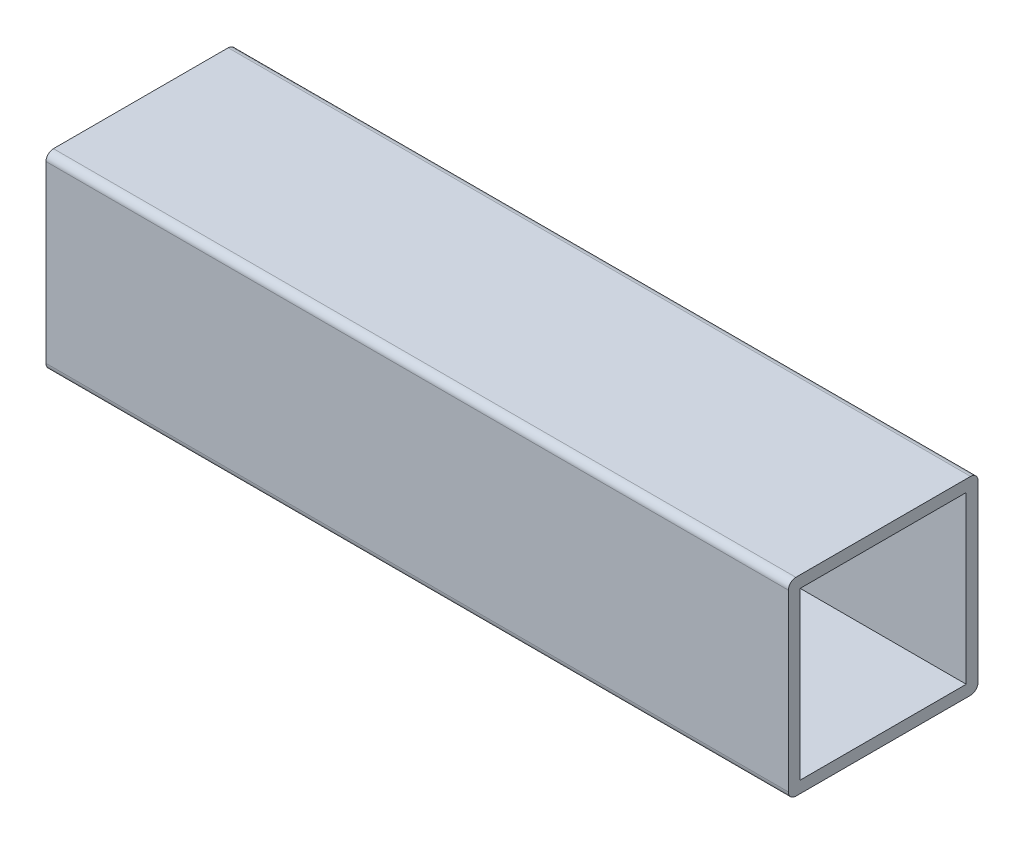
ISO-10303-21;
HEADER;
FILE_DESCRIPTION(('STEP AP214'),'2;1');
FILE_NAME('part.step','',(''),(''),'','','');
FILE_SCHEMA(('AUTOMOTIVE_DESIGN { 1 0 10303 214 1 1 1 1 }'));
ENDSEC;
DATA;
#1=APPLICATION_CONTEXT('core data for automotive mechanical design processes');
#2=APPLICATION_PROTOCOL_DEFINITION('international standard','automotive_design',2000,#1);
#3=PRODUCT_CONTEXT('',#1,'mechanical');
#4=PRODUCT('Part','Part','',(#3));
#5=PRODUCT_RELATED_PRODUCT_CATEGORY('part','',(#4));
#6=PRODUCT_DEFINITION_FORMATION('','',#4);
#7=PRODUCT_DEFINITION_CONTEXT('part definition',#1,'design');
#8=PRODUCT_DEFINITION('design','',#6,#7);
#9=PRODUCT_DEFINITION_SHAPE('','',#8);
#10=(LENGTH_UNIT() NAMED_UNIT(*) SI_UNIT(.MILLI.,.METRE.));
#11=(NAMED_UNIT(*) PLANE_ANGLE_UNIT() SI_UNIT($,.RADIAN.));
#12=(NAMED_UNIT(*) SI_UNIT($,.STERADIAN.) SOLID_ANGLE_UNIT());
#13=UNCERTAINTY_MEASURE_WITH_UNIT(LENGTH_MEASURE(1.E-05),#10,'distance_accuracy_value','');
#14=(GEOMETRIC_REPRESENTATION_CONTEXT(3) GLOBAL_UNCERTAINTY_ASSIGNED_CONTEXT((#13)) GLOBAL_UNIT_ASSIGNED_CONTEXT((#10,
#11,#12)) REPRESENTATION_CONTEXT('',''));
#15=CARTESIAN_POINT('',(0.,0.,0.));
#16=DIRECTION('',(0.,0.,1.));
#17=DIRECTION('',(1.,0.,0.));
#18=AXIS2_PLACEMENT_3D('',#15,#16,#17);
#19=CARTESIAN_POINT('',(-50.,-12.77,-12.77));
#20=DIRECTION('',(0.,0.,-1.));
#21=DIRECTION('',(-1.,0.,0.));
#22=AXIS2_PLACEMENT_3D('',#19,#20,#21);
#23=PLANE('',#22);
#24=DIRECTION('',(0.,1.,0.));
#25=VECTOR('',#24,1.);
#26=CARTESIAN_POINT('',(-50.,-12.77,-12.77));
#27=LINE('',#26,#25);
#28=CARTESIAN_POINT('',(-50.,-11.77,-12.77));
#29=VERTEX_POINT('',#28);
#30=CARTESIAN_POINT('',(-50.,11.77,-12.77));
#31=VERTEX_POINT('',#30);
#32=EDGE_CURVE('E175',#29,#31,#27,.T.);
#33=ORIENTED_EDGE('',*,*,#32,.T.);
#34=DIRECTION('',(1.,0.,0.));
#35=VECTOR('',#34,1.);
#36=CARTESIAN_POINT('',(-50.,11.77,-12.77));
#37=LINE('',#36,#35);
#38=CARTESIAN_POINT('',(50.,11.77,-12.77));
#39=VERTEX_POINT('',#38);
#40=EDGE_CURVE('E216',#31,#39,#37,.T.);
#41=ORIENTED_EDGE('',*,*,#40,.T.);
#42=DIRECTION('',(0.,1.,0.));
#43=VECTOR('',#42,1.);
#44=CARTESIAN_POINT('',(50.,-12.77,-12.77));
#45=LINE('',#44,#43);
#46=CARTESIAN_POINT('',(50.,-11.77,-12.77));
#47=VERTEX_POINT('',#46);
#48=EDGE_CURVE('E154',#47,#39,#45,.T.);
#49=ORIENTED_EDGE('',*,*,#48,.F.);
#50=DIRECTION('',(1.,0.,0.));
#51=VECTOR('',#50,1.);
#52=CARTESIAN_POINT('',(-50.,-11.77,-12.77));
#53=LINE('',#52,#51);
#54=EDGE_CURVE('E214',#47,#29,#53,.F.);
#55=ORIENTED_EDGE('',*,*,#54,.T.);
#56=EDGE_LOOP('',(#33,#41,#49,#55));
#57=FACE_BOUND('',#56,.T.);
#58=ADVANCED_FACE('F33',(#57),#23,.T.);
#59=CARTESIAN_POINT('',(-50.,-12.77,12.77));
#60=DIRECTION('',(0.,-1.,0.));
#61=DIRECTION('',(0.,0.,-1.));
#62=AXIS2_PLACEMENT_3D('',#59,#60,#61);
#63=PLANE('',#62);
#64=DIRECTION('',(0.,0.,-1.));
#65=VECTOR('',#64,1.);
#66=CARTESIAN_POINT('',(-50.,-12.77,12.77));
#67=LINE('',#66,#65);
#68=CARTESIAN_POINT('',(-50.,-12.77,11.77));
#69=VERTEX_POINT('',#68);
#70=CARTESIAN_POINT('',(-50.,-12.77,-11.77));
#71=VERTEX_POINT('',#70);
#72=EDGE_CURVE('E187',#69,#71,#67,.T.);
#73=ORIENTED_EDGE('',*,*,#72,.T.);
#74=DIRECTION('',(1.,0.,0.));
#75=VECTOR('',#74,1.);
#76=CARTESIAN_POINT('',(-50.,-12.77,-11.77));
#77=LINE('',#76,#75);
#78=CARTESIAN_POINT('',(50.,-12.77,-11.77));
#79=VERTEX_POINT('',#78);
#80=EDGE_CURVE('E11',#71,#79,#77,.T.);
#81=ORIENTED_EDGE('',*,*,#80,.T.);
#82=DIRECTION('',(0.,0.,-1.));
#83=VECTOR('',#82,1.);
#84=CARTESIAN_POINT('',(50.,-12.77,12.77));
#85=LINE('',#84,#83);
#86=CARTESIAN_POINT('',(50.,-12.77,11.77));
#87=VERTEX_POINT('',#86);
#88=EDGE_CURVE('E163',#87,#79,#85,.T.);
#89=ORIENTED_EDGE('',*,*,#88,.F.);
#90=DIRECTION('',(1.,0.,0.));
#91=VECTOR('',#90,1.);
#92=CARTESIAN_POINT('',(-50.,-12.77,11.77));
#93=LINE('',#92,#91);
#94=EDGE_CURVE('E41',#87,#69,#93,.F.);
#95=ORIENTED_EDGE('',*,*,#94,.T.);
#96=EDGE_LOOP('',(#73,#81,#89,#95));
#97=FACE_BOUND('',#96,.T.);
#98=ADVANCED_FACE('F229',(#97),#63,.T.);
#99=CARTESIAN_POINT('',(-50.,-12.77,12.77));
#100=DIRECTION('',(0.,0.,1.));
#101=DIRECTION('',(1.,0.,0.));
#102=AXIS2_PLACEMENT_3D('',#99,#100,#101);
#103=PLANE('',#102);
#104=DIRECTION('',(0.,-1.,0.));
#105=VECTOR('',#104,1.);
#106=CARTESIAN_POINT('',(50.,-12.77,12.77));
#107=LINE('',#106,#105);
#108=CARTESIAN_POINT('',(50.,11.77,12.77));
#109=VERTEX_POINT('',#108);
#110=CARTESIAN_POINT('',(50.,-11.77,12.77));
#111=VERTEX_POINT('',#110);
#112=EDGE_CURVE('E160',#109,#111,#107,.T.);
#113=ORIENTED_EDGE('',*,*,#112,.F.);
#114=DIRECTION('',(1.,0.,0.));
#115=VECTOR('',#114,1.);
#116=CARTESIAN_POINT('',(-50.,11.77,12.77));
#117=LINE('',#116,#115);
#118=CARTESIAN_POINT('',(-50.,11.77,12.77));
#119=VERTEX_POINT('',#118);
#120=EDGE_CURVE('E205',#109,#119,#117,.F.);
#121=ORIENTED_EDGE('',*,*,#120,.T.);
#122=DIRECTION('',(0.,-1.,0.));
#123=VECTOR('',#122,1.);
#124=CARTESIAN_POINT('',(-50.,-12.77,12.77));
#125=LINE('',#124,#123);
#126=CARTESIAN_POINT('',(-50.,-11.77,12.77));
#127=VERTEX_POINT('',#126);
#128=EDGE_CURVE('E184',#119,#127,#125,.T.);
#129=ORIENTED_EDGE('',*,*,#128,.T.);
#130=DIRECTION('',(1.,0.,0.));
#131=VECTOR('',#130,1.);
#132=CARTESIAN_POINT('',(-50.,-11.77,12.77));
#133=LINE('',#132,#131);
#134=EDGE_CURVE('E202',#127,#111,#133,.T.);
#135=ORIENTED_EDGE('',*,*,#134,.T.);
#136=EDGE_LOOP('',(#113,#121,#129,#135));
#137=FACE_BOUND('',#136,.T.);
#138=ADVANCED_FACE('F237',(#137),#103,.T.);
#139=CARTESIAN_POINT('',(-50.,12.77,12.77));
#140=DIRECTION('',(0.,1.,0.));
#141=DIRECTION('',(0.,0.,1.));
#142=AXIS2_PLACEMENT_3D('',#139,#140,#141);
#143=PLANE('',#142);
#144=DIRECTION('',(0.,0.,1.));
#145=VECTOR('',#144,1.);
#146=CARTESIAN_POINT('',(-50.,12.77,12.77));
#147=LINE('',#146,#145);
#148=CARTESIAN_POINT('',(-50.,12.77,-11.77));
#149=VERTEX_POINT('',#148);
#150=CARTESIAN_POINT('',(-50.,12.77,11.77));
#151=VERTEX_POINT('',#150);
#152=EDGE_CURVE('E181',#149,#151,#147,.T.);
#153=ORIENTED_EDGE('',*,*,#152,.T.);
#154=DIRECTION('',(1.,0.,0.));
#155=VECTOR('',#154,1.);
#156=CARTESIAN_POINT('',(-50.,12.77,11.77));
#157=LINE('',#156,#155);
#158=CARTESIAN_POINT('',(50.,12.77,11.77));
#159=VERTEX_POINT('',#158);
#160=EDGE_CURVE('E191',#151,#159,#157,.T.);
#161=ORIENTED_EDGE('',*,*,#160,.T.);
#162=DIRECTION('',(0.,0.,1.));
#163=VECTOR('',#162,1.);
#164=CARTESIAN_POINT('',(50.,12.77,12.77));
#165=LINE('',#164,#163);
#166=CARTESIAN_POINT('',(50.,12.77,-11.77));
#167=VERTEX_POINT('',#166);
#168=EDGE_CURVE('E157',#167,#159,#165,.T.);
#169=ORIENTED_EDGE('',*,*,#168,.F.);
#170=DIRECTION('',(1.,0.,0.));
#171=VECTOR('',#170,1.);
#172=CARTESIAN_POINT('',(-50.,12.77,-11.77));
#173=LINE('',#172,#171);
#174=EDGE_CURVE('E189',#167,#149,#173,.F.);
#175=ORIENTED_EDGE('',*,*,#174,.T.);
#176=EDGE_LOOP('',(#153,#161,#169,#175));
#177=FACE_BOUND('',#176,.T.);
#178=ADVANCED_FACE('F244',(#177),#143,.T.);
#179=CARTESIAN_POINT('',(-50.,0.,0.));
#180=DIRECTION('',(-1.,0.,0.));
#181=DIRECTION('',(0.,0.,1.));
#182=AXIS2_PLACEMENT_3D('',#179,#180,#181);
#183=PLANE('',#182);
#184=DIRECTION('',(0.,0.,-1.));
#185=VECTOR('',#184,1.);
#186=CARTESIAN_POINT('',(-50.,-11.1825,11.1825));
#187=LINE('',#186,#185);
#188=CARTESIAN_POINT('',(-50.,-11.1825,11.1825));
#189=VERTEX_POINT('',#188);
#190=CARTESIAN_POINT('',(-50.,-11.1825,-11.1825));
#191=VERTEX_POINT('',#190);
#192=EDGE_CURVE('E166',#189,#191,#187,.T.);
#193=ORIENTED_EDGE('',*,*,#192,.T.);
#194=DIRECTION('',(0.,1.,0.));
#195=VECTOR('',#194,1.);
#196=CARTESIAN_POINT('',(-50.,-11.1825,-11.1825));
#197=LINE('',#196,#195);
#198=CARTESIAN_POINT('',(-50.,11.1825,-11.1825));
#199=VERTEX_POINT('',#198);
#200=EDGE_CURVE('E131',#191,#199,#197,.T.);
#201=ORIENTED_EDGE('',*,*,#200,.T.);
#202=DIRECTION('',(0.,0.,1.));
#203=VECTOR('',#202,1.);
#204=CARTESIAN_POINT('',(-50.,11.1825,11.1825));
#205=LINE('',#204,#203);
#206=CARTESIAN_POINT('',(-50.,11.1825,11.1825));
#207=VERTEX_POINT('',#206);
#208=EDGE_CURVE('E169',#199,#207,#205,.T.);
#209=ORIENTED_EDGE('',*,*,#208,.T.);
#210=DIRECTION('',(0.,-1.,0.));
#211=VECTOR('',#210,1.);
#212=CARTESIAN_POINT('',(-50.,-11.1825,11.1825));
#213=LINE('',#212,#211);
#214=EDGE_CURVE('E136',#207,#189,#213,.T.);
#215=ORIENTED_EDGE('',*,*,#214,.T.);
#216=EDGE_LOOP('',(#193,#201,#209,#215));
#217=FACE_BOUND('',#216,.T.);
#218=ORIENTED_EDGE('',*,*,#128,.F.);
#219=CARTESIAN_POINT('',(-50.,11.77,11.77));
#220=DIRECTION('',(-1.,0.,0.));
#221=DIRECTION('',(0.,0.,1.));
#222=AXIS2_PLACEMENT_3D('',#219,#220,#221);
#223=CIRCLE('',#222,1.);
#224=EDGE_CURVE('E212',#119,#151,#223,.T.);
#225=ORIENTED_EDGE('',*,*,#224,.T.);
#226=ORIENTED_EDGE('',*,*,#152,.F.);
#227=CARTESIAN_POINT('',(-50.,11.77,-11.77));
#228=DIRECTION('',(-1.,0.,0.));
#229=DIRECTION('',(0.,0.,1.));
#230=AXIS2_PLACEMENT_3D('',#227,#228,#229);
#231=CIRCLE('',#230,1.);
#232=EDGE_CURVE('E210',#149,#31,#231,.T.);
#233=ORIENTED_EDGE('',*,*,#232,.T.);
#234=ORIENTED_EDGE('',*,*,#32,.F.);
#235=CARTESIAN_POINT('',(-50.,-11.77,-11.77));
#236=DIRECTION('',(-1.,0.,0.));
#237=DIRECTION('',(0.,0.,1.));
#238=AXIS2_PLACEMENT_3D('',#235,#236,#237);
#239=CIRCLE('',#238,1.);
#240=EDGE_CURVE('E48',#29,#71,#239,.T.);
#241=ORIENTED_EDGE('',*,*,#240,.T.);
#242=ORIENTED_EDGE('',*,*,#72,.F.);
#243=CARTESIAN_POINT('',(-50.,-11.77,11.77));
#244=DIRECTION('',(-1.,0.,0.));
#245=DIRECTION('',(0.,0.,1.));
#246=AXIS2_PLACEMENT_3D('',#243,#244,#245);
#247=CIRCLE('',#246,1.);
#248=EDGE_CURVE('E207',#69,#127,#247,.T.);
#249=ORIENTED_EDGE('',*,*,#248,.T.);
#250=EDGE_LOOP('',(#218,#225,#226,#233,#234,#241,#242,#249));
#251=FACE_BOUND('',#250,.T.);
#252=ADVANCED_FACE('F232',(#217,#251),#183,.T.);
#253=CARTESIAN_POINT('',(-50.,-11.1825,11.1825));
#254=DIRECTION('',(0.,-1.,0.));
#255=DIRECTION('',(0.,0.,-1.));
#256=AXIS2_PLACEMENT_3D('',#253,#254,#255);
#257=PLANE('',#256);
#258=DIRECTION('',(1.,0.,0.));
#259=VECTOR('',#258,1.);
#260=CARTESIAN_POINT('',(-50.,-11.1825,11.1825));
#261=LINE('',#260,#259);
#262=CARTESIAN_POINT('',(50.,-11.1825,11.1825));
#263=VERTEX_POINT('',#262);
#264=EDGE_CURVE('E141',#189,#263,#261,.T.);
#265=ORIENTED_EDGE('',*,*,#264,.T.);
#266=DIRECTION('',(0.,0.,-1.));
#267=VECTOR('',#266,1.);
#268=CARTESIAN_POINT('',(50.,-11.1825,11.1825));
#269=LINE('',#268,#267);
#270=CARTESIAN_POINT('',(50.,-11.1825,-11.1825));
#271=VERTEX_POINT('',#270);
#272=EDGE_CURVE('E139',#263,#271,#269,.T.);
#273=ORIENTED_EDGE('',*,*,#272,.T.);
#274=DIRECTION('',(1.,0.,0.));
#275=VECTOR('',#274,1.);
#276=CARTESIAN_POINT('',(-50.,-11.1825,-11.1825));
#277=LINE('',#276,#275);
#278=EDGE_CURVE('E123',#191,#271,#277,.T.);
#279=ORIENTED_EDGE('',*,*,#278,.F.);
#280=ORIENTED_EDGE('',*,*,#192,.F.);
#281=EDGE_LOOP('',(#265,#273,#279,#280));
#282=FACE_BOUND('',#281,.T.);
#283=ADVANCED_FACE('F140',(#282),#257,.F.);
#284=CARTESIAN_POINT('',(-50.,-11.1825,11.1825));
#285=DIRECTION('',(0.,0.,1.));
#286=DIRECTION('',(1.,0.,0.));
#287=AXIS2_PLACEMENT_3D('',#284,#285,#286);
#288=PLANE('',#287);
#289=DIRECTION('',(1.,0.,0.));
#290=VECTOR('',#289,1.);
#291=CARTESIAN_POINT('',(-50.,11.1825,11.1825));
#292=LINE('',#291,#290);
#293=CARTESIAN_POINT('',(50.,11.1825,11.1825));
#294=VERTEX_POINT('',#293);
#295=EDGE_CURVE('E176',#207,#294,#292,.T.);
#296=ORIENTED_EDGE('',*,*,#295,.T.);
#297=DIRECTION('',(0.,-1.,0.));
#298=VECTOR('',#297,1.);
#299=CARTESIAN_POINT('',(50.,-11.1825,11.1825));
#300=LINE('',#299,#298);
#301=EDGE_CURVE('E150',#294,#263,#300,.T.);
#302=ORIENTED_EDGE('',*,*,#301,.T.);
#303=ORIENTED_EDGE('',*,*,#264,.F.);
#304=ORIENTED_EDGE('',*,*,#214,.F.);
#305=EDGE_LOOP('',(#296,#302,#303,#304));
#306=FACE_BOUND('',#305,.T.);
#307=ADVANCED_FACE('F272',(#306),#288,.F.);
#308=CARTESIAN_POINT('',(-50.,11.1825,11.1825));
#309=DIRECTION('',(0.,1.,0.));
#310=DIRECTION('',(0.,0.,1.));
#311=AXIS2_PLACEMENT_3D('',#308,#309,#310);
#312=PLANE('',#311);
#313=DIRECTION('',(1.,0.,0.));
#314=VECTOR('',#313,1.);
#315=CARTESIAN_POINT('',(-50.,11.1825,-11.1825));
#316=LINE('',#315,#314);
#317=CARTESIAN_POINT('',(50.,11.1825,-11.1825));
#318=VERTEX_POINT('',#317);
#319=EDGE_CURVE('E135',#199,#318,#316,.T.);
#320=ORIENTED_EDGE('',*,*,#319,.T.);
#321=DIRECTION('',(0.,0.,1.));
#322=VECTOR('',#321,1.);
#323=CARTESIAN_POINT('',(50.,11.1825,11.1825));
#324=LINE('',#323,#322);
#325=EDGE_CURVE('E148',#318,#294,#324,.T.);
#326=ORIENTED_EDGE('',*,*,#325,.T.);
#327=ORIENTED_EDGE('',*,*,#295,.F.);
#328=ORIENTED_EDGE('',*,*,#208,.F.);
#329=EDGE_LOOP('',(#320,#326,#327,#328));
#330=FACE_BOUND('',#329,.T.);
#331=ADVANCED_FACE('F275',(#330),#312,.F.);
#332=CARTESIAN_POINT('',(-50.,-11.1825,-11.1825));
#333=DIRECTION('',(0.,0.,-1.));
#334=DIRECTION('',(-1.,0.,0.));
#335=AXIS2_PLACEMENT_3D('',#332,#333,#334);
#336=PLANE('',#335);
#337=ORIENTED_EDGE('',*,*,#278,.T.);
#338=DIRECTION('',(0.,1.,0.));
#339=VECTOR('',#338,1.);
#340=CARTESIAN_POINT('',(50.,-11.1825,-11.1825));
#341=LINE('',#340,#339);
#342=EDGE_CURVE('E128',#271,#318,#341,.T.);
#343=ORIENTED_EDGE('',*,*,#342,.T.);
#344=ORIENTED_EDGE('',*,*,#319,.F.);
#345=ORIENTED_EDGE('',*,*,#200,.F.);
#346=EDGE_LOOP('',(#337,#343,#344,#345));
#347=FACE_BOUND('',#346,.T.);
#348=ADVANCED_FACE('F125',(#347),#336,.F.);
#349=CARTESIAN_POINT('',(50.,0.,0.));
#350=DIRECTION('',(-1.,0.,0.));
#351=DIRECTION('',(0.,0.,1.));
#352=AXIS2_PLACEMENT_3D('',#349,#350,#351);
#353=PLANE('',#352);
#354=ORIENTED_EDGE('',*,*,#168,.T.);
#355=CARTESIAN_POINT('',(50.,11.77,11.77));
#356=DIRECTION('',(-1.,0.,0.));
#357=DIRECTION('',(0.,0.,1.));
#358=AXIS2_PLACEMENT_3D('',#355,#356,#357);
#359=CIRCLE('',#358,1.);
#360=EDGE_CURVE('E200',#159,#109,#359,.F.);
#361=ORIENTED_EDGE('',*,*,#360,.T.);
#362=ORIENTED_EDGE('',*,*,#112,.T.);
#363=CARTESIAN_POINT('',(50.,-11.77,11.77));
#364=DIRECTION('',(-1.,0.,0.));
#365=DIRECTION('',(0.,0.,1.));
#366=AXIS2_PLACEMENT_3D('',#363,#364,#365);
#367=CIRCLE('',#366,1.);
#368=EDGE_CURVE('E194',#111,#87,#367,.F.);
#369=ORIENTED_EDGE('',*,*,#368,.T.);
#370=ORIENTED_EDGE('',*,*,#88,.T.);
#371=CARTESIAN_POINT('',(50.,-11.77,-11.77));
#372=DIRECTION('',(-1.,0.,0.));
#373=DIRECTION('',(0.,0.,1.));
#374=AXIS2_PLACEMENT_3D('',#371,#372,#373);
#375=CIRCLE('',#374,1.);
#376=EDGE_CURVE('E196',#79,#47,#375,.F.);
#377=ORIENTED_EDGE('',*,*,#376,.T.);
#378=ORIENTED_EDGE('',*,*,#48,.T.);
#379=CARTESIAN_POINT('',(50.,11.77,-11.77));
#380=DIRECTION('',(-1.,0.,0.));
#381=DIRECTION('',(0.,0.,1.));
#382=AXIS2_PLACEMENT_3D('',#379,#380,#381);
#383=CIRCLE('',#382,1.);
#384=EDGE_CURVE('E198',#39,#167,#383,.F.);
#385=ORIENTED_EDGE('',*,*,#384,.T.);
#386=EDGE_LOOP('',(#354,#361,#362,#369,#370,#377,#378,#385));
#387=FACE_BOUND('',#386,.T.);
#388=ORIENTED_EDGE('',*,*,#272,.F.);
#389=ORIENTED_EDGE('',*,*,#301,.F.);
#390=ORIENTED_EDGE('',*,*,#325,.F.);
#391=ORIENTED_EDGE('',*,*,#342,.F.);
#392=EDGE_LOOP('',(#388,#389,#390,#391));
#393=FACE_BOUND('',#392,.T.);
#394=ADVANCED_FACE('F146',(#387,#393),#353,.F.);
#395=CARTESIAN_POINT('',(-50.,11.77,11.77));
#396=DIRECTION('',(1.,0.,0.));
#397=DIRECTION('',(0.,0.,-1.));
#398=AXIS2_PLACEMENT_3D('',#395,#396,#397);
#399=CYLINDRICAL_SURFACE('',#398,1.);
#400=ORIENTED_EDGE('',*,*,#224,.F.);
#401=ORIENTED_EDGE('',*,*,#120,.F.);
#402=ORIENTED_EDGE('',*,*,#360,.F.);
#403=ORIENTED_EDGE('',*,*,#160,.F.);
#404=EDGE_LOOP('',(#400,#401,#402,#403));
#405=FACE_BOUND('',#404,.T.);
#406=ADVANCED_FACE('F242',(#405),#399,.T.);
#407=CARTESIAN_POINT('',(-50.,11.77,-11.77));
#408=DIRECTION('',(1.,0.,0.));
#409=DIRECTION('',(0.,0.,-1.));
#410=AXIS2_PLACEMENT_3D('',#407,#408,#409);
#411=CYLINDRICAL_SURFACE('',#410,1.);
#412=ORIENTED_EDGE('',*,*,#232,.F.);
#413=ORIENTED_EDGE('',*,*,#174,.F.);
#414=ORIENTED_EDGE('',*,*,#384,.F.);
#415=ORIENTED_EDGE('',*,*,#40,.F.);
#416=EDGE_LOOP('',(#412,#413,#414,#415));
#417=FACE_BOUND('',#416,.T.);
#418=ADVANCED_FACE('F247',(#417),#411,.T.);
#419=CARTESIAN_POINT('',(-50.,-11.77,-11.77));
#420=DIRECTION('',(1.,0.,0.));
#421=DIRECTION('',(0.,0.,-1.));
#422=AXIS2_PLACEMENT_3D('',#419,#420,#421);
#423=CYLINDRICAL_SURFACE('',#422,1.);
#424=ORIENTED_EDGE('',*,*,#240,.F.);
#425=ORIENTED_EDGE('',*,*,#54,.F.);
#426=ORIENTED_EDGE('',*,*,#376,.F.);
#427=ORIENTED_EDGE('',*,*,#80,.F.);
#428=EDGE_LOOP('',(#424,#425,#426,#427));
#429=FACE_BOUND('',#428,.T.);
#430=ADVANCED_FACE('F228',(#429),#423,.T.);
#431=CARTESIAN_POINT('',(-50.,-11.77,11.77));
#432=DIRECTION('',(1.,0.,0.));
#433=DIRECTION('',(0.,0.,-1.));
#434=AXIS2_PLACEMENT_3D('',#431,#432,#433);
#435=CYLINDRICAL_SURFACE('',#434,1.);
#436=ORIENTED_EDGE('',*,*,#248,.F.);
#437=ORIENTED_EDGE('',*,*,#94,.F.);
#438=ORIENTED_EDGE('',*,*,#368,.F.);
#439=ORIENTED_EDGE('',*,*,#134,.F.);
#440=EDGE_LOOP('',(#436,#437,#438,#439));
#441=FACE_BOUND('',#440,.T.);
#442=ADVANCED_FACE('F35',(#441),#435,.T.);
#443=CLOSED_SHELL('',(#58,#98,#138,#178,#252,#283,#307,#331,#348,#394,#406,#418,#430,#442));
#444=MANIFOLD_SOLID_BREP('B2',#443);
#445=ADVANCED_BREP_SHAPE_REPRESENTATION('',(#18,#444),#14);
#446=SHAPE_DEFINITION_REPRESENTATION(#9,#445);
ENDSEC;
END-ISO-10303-21;
